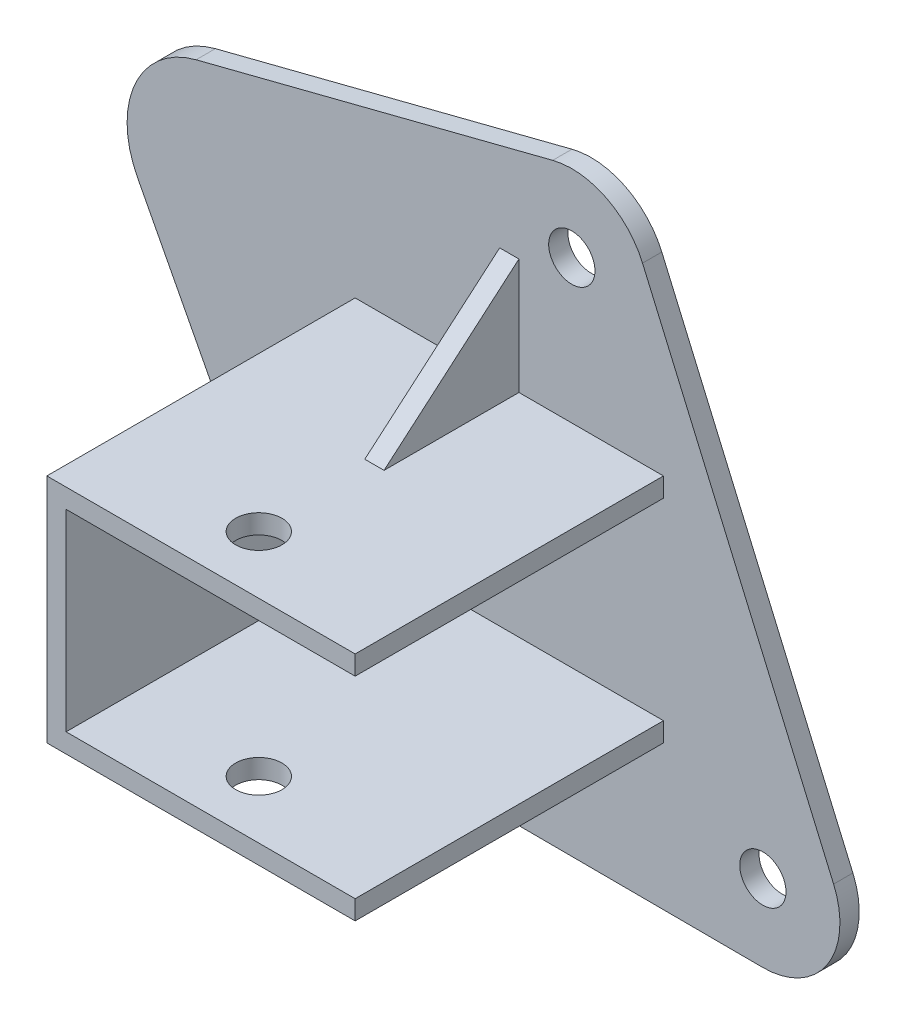
ISO-10303-21;
HEADER;
FILE_DESCRIPTION(('STEP AP214'),'2;1');
FILE_NAME('part.step','',(''),(''),'','','');
FILE_SCHEMA(('AUTOMOTIVE_DESIGN { 1 0 10303 214 1 1 1 1 }'));
ENDSEC;
DATA;
#1=APPLICATION_CONTEXT('core data for automotive mechanical design processes');
#2=APPLICATION_PROTOCOL_DEFINITION('international standard','automotive_design',2000,#1);
#3=PRODUCT_CONTEXT('',#1,'mechanical');
#4=PRODUCT('Part','Part','',(#3));
#5=PRODUCT_RELATED_PRODUCT_CATEGORY('part','',(#4));
#6=PRODUCT_DEFINITION_FORMATION('','',#4);
#7=PRODUCT_DEFINITION_CONTEXT('part definition',#1,'design');
#8=PRODUCT_DEFINITION('design','',#6,#7);
#9=PRODUCT_DEFINITION_SHAPE('','',#8);
#10=(LENGTH_UNIT() NAMED_UNIT(*) SI_UNIT(.MILLI.,.METRE.));
#11=(NAMED_UNIT(*) PLANE_ANGLE_UNIT() SI_UNIT($,.RADIAN.));
#12=(NAMED_UNIT(*) SI_UNIT($,.STERADIAN.) SOLID_ANGLE_UNIT());
#13=UNCERTAINTY_MEASURE_WITH_UNIT(LENGTH_MEASURE(1.E-05),#10,'distance_accuracy_value','');
#14=(GEOMETRIC_REPRESENTATION_CONTEXT(3) GLOBAL_UNCERTAINTY_ASSIGNED_CONTEXT((#13)) GLOBAL_UNIT_ASSIGNED_CONTEXT((#10,
#11,#12)) REPRESENTATION_CONTEXT('',''));
#15=CARTESIAN_POINT('',(0.,0.,0.));
#16=DIRECTION('',(0.,0.,1.));
#17=DIRECTION('',(1.,0.,0.));
#18=AXIS2_PLACEMENT_3D('',#15,#16,#17);
#19=CARTESIAN_POINT('',(0.,0.,5.));
#20=DIRECTION('',(0.,0.,-1.));
#21=DIRECTION('',(-1.,0.,0.));
#22=AXIS2_PLACEMENT_3D('',#19,#20,#21);
#23=PLANE('',#22);
#24=CARTESIAN_POINT('',(-530.,114.747437118608,5.));
#25=DIRECTION('',(0.,0.,1.));
#26=DIRECTION('',(1.,0.,0.));
#27=AXIS2_PLACEMENT_3D('',#24,#25,#26);
#28=CIRCLE('',#27,5.99999999999999);
#29=CARTESIAN_POINT('',(-524.,114.747437118608,5.));
#30=VERTEX_POINT('',#29);
#31=EDGE_CURVE('E361',#30,#30,#28,.T.);
#32=ORIENTED_EDGE('',*,*,#31,.F.);
#33=EDGE_LOOP('',(#32));
#34=FACE_BOUND('',#33,.T.);
#35=CARTESIAN_POINT('',(-480.421520044367,0.,5.));
#36=DIRECTION('',(0.,0.,1.));
#37=DIRECTION('',(1.,0.,0.));
#38=AXIS2_PLACEMENT_3D('',#35,#36,#37);
#39=CIRCLE('',#38,5.99999999999999);
#40=CARTESIAN_POINT('',(-474.421520044367,0.,5.));
#41=VERTEX_POINT('',#40);
#42=EDGE_CURVE('E367',#41,#41,#39,.T.);
#43=ORIENTED_EDGE('',*,*,#42,.F.);
#44=EDGE_LOOP('',(#43));
#45=FACE_BOUND('',#44,.T.);
#46=CARTESIAN_POINT('',(-580.420844253883,0.367637919948348,5.));
#47=DIRECTION('',(0.,0.,1.));
#48=DIRECTION('',(1.,0.,0.));
#49=AXIS2_PLACEMENT_3D('',#46,#47,#48);
#50=CIRCLE('',#49,5.99999999999999);
#51=CARTESIAN_POINT('',(-574.420844253883,0.367637919948348,5.));
#52=VERTEX_POINT('',#51);
#53=EDGE_CURVE('E11',#52,#52,#50,.T.);
#54=ORIENTED_EDGE('',*,*,#53,.F.);
#55=EDGE_LOOP('',(#54));
#56=FACE_BOUND('',#55,.T.);
#57=CARTESIAN_POINT('',(-480.421520044367,0.,5.));
#58=DIRECTION('',(0.,0.,1.));
#59=DIRECTION('',(1.,0.,0.));
#60=AXIS2_PLACEMENT_3D('',#57,#58,#59);
#61=CIRCLE('',#60,20.);
#62=CARTESIAN_POINT('',(-480.495047628357,-19.9998648419031,5.));
#63=VERTEX_POINT('',#62);
#64=CARTESIAN_POINT('',(-462.06193010539,7.93255679290131,5.));
#65=VERTEX_POINT('',#64);
#66=EDGE_CURVE('E318',#63,#65,#61,.T.);
#67=ORIENTED_EDGE('',*,*,#66,.T.);
#68=DIRECTION('',(-0.396627839645065,0.917979496948863,0.));
#69=VECTOR('',#68,1.);
#70=CARTESIAN_POINT('',(-511.640410061023,122.679993911509,5.));
#71=LINE('',#70,#69);
#72=CARTESIAN_POINT('',(-511.640410061023,122.679993911509,5.));
#73=VERTEX_POINT('',#72);
#74=EDGE_CURVE('E320',#65,#73,#71,.T.);
#75=ORIENTED_EDGE('',*,*,#74,.T.);
#76=CARTESIAN_POINT('',(-530.,114.747437118608,5.));
#77=DIRECTION('',(0.,0.,1.));
#78=DIRECTION('',(1.,0.,0.));
#79=AXIS2_PLACEMENT_3D('',#76,#77,#78);
#80=CIRCLE('',#79,19.9999999999999);
#81=CARTESIAN_POINT('',(-534.956009312539,134.123658930252,5.));
#82=VERTEX_POINT('',#81);
#83=EDGE_CURVE('E322',#73,#82,#80,.T.);
#84=ORIENTED_EDGE('',*,*,#83,.T.);
#85=DIRECTION('',(-0.968811090582201,-0.247800465626937,0.));
#86=VECTOR('',#85,1.);
#87=CARTESIAN_POINT('',(-534.956009312539,134.123658930252,5.));
#88=LINE('',#87,#86);
#89=CARTESIAN_POINT('',(-627.481332722389,110.457726070766,5.));
#90=VERTEX_POINT('',#89);
#91=EDGE_CURVE('E324',#82,#90,#88,.T.);
#92=ORIENTED_EDGE('',*,*,#91,.T.);
#93=CARTESIAN_POINT('',(-621.583666123486,87.3999614490659,5.));
#94=DIRECTION('',(0.,0.,1.));
#95=DIRECTION('',(1.,0.,0.));
#96=AXIS2_PLACEMENT_3D('',#93,#94,#95);
#97=CIRCLE('',#96,23.8000626188574);
#98=CARTESIAN_POINT('',(-642.680296555171,76.3829216882936,5.));
#99=VERTEX_POINT('',#98);
#100=EDGE_CURVE('E326',#90,#99,#97,.T.);
#101=ORIENTED_EDGE('',*,*,#100,.T.);
#102=DIRECTION('',(0.462899612375104,-0.886410711162144,0.));
#103=VECTOR('',#102,1.);
#104=CARTESIAN_POINT('',(-642.680296555171,76.3829216882936,5.));
#105=LINE('',#104,#103);
#106=CARTESIAN_POINT('',(-598.149058477126,-8.89035432755369,5.));
#107=VERTEX_POINT('',#106);
#108=EDGE_CURVE('E328',#99,#107,#105,.T.);
#109=ORIENTED_EDGE('',*,*,#108,.T.);
#110=CARTESIAN_POINT('',(-580.420844253883,0.367637919948348,5.));
#111=DIRECTION('',(0.,0.,1.));
#112=DIRECTION('',(1.,0.,0.));
#113=AXIS2_PLACEMENT_3D('',#110,#111,#112);
#114=CIRCLE('',#113,20.);
#115=CARTESIAN_POINT('',(-580.494371837872,-19.6322269219548,5.));
#116=VERTEX_POINT('',#115);
#117=EDGE_CURVE('E330',#107,#116,#114,.T.);
#118=ORIENTED_EDGE('',*,*,#117,.T.);
#119=DIRECTION('',(0.999993242095156,-0.00367637919948347,0.));
#120=VECTOR('',#119,1.);
#121=CARTESIAN_POINT('',(-580.494371837872,-19.6322269219548,5.));
#122=LINE('',#121,#120);
#123=EDGE_CURVE('E332',#116,#63,#122,.T.);
#124=ORIENTED_EDGE('',*,*,#123,.T.);
#125=EDGE_LOOP('',(#67,#75,#84,#92,#101,#109,#118,#124));
#126=FACE_BOUND('',#125,.T.);
#127=DIRECTION('',(1.,0.,0.));
#128=VECTOR('',#127,1.);
#129=CARTESIAN_POINT('',(-548.713116183473,-12.425240331968,5.));
#130=LINE('',#129,#128);
#131=CARTESIAN_POINT('',(-548.713116183473,-12.425240331968,5.));
#132=VERTEX_POINT('',#131);
#133=CARTESIAN_POINT('',(-543.713116183473,-12.425240331968,5.));
#134=VERTEX_POINT('',#133);
#135=EDGE_CURVE('E48',#132,#134,#130,.T.);
#136=ORIENTED_EDGE('',*,*,#135,.F.);
#137=DIRECTION('',(0.,-1.,0.));
#138=VECTOR('',#137,1.);
#139=CARTESIAN_POINT('',(-548.713116183473,17.574759668032,5.));
#140=LINE('',#139,#138);
#141=CARTESIAN_POINT('',(-548.713116183473,17.574759668032,5.));
#142=VERTEX_POINT('',#141);
#143=EDGE_CURVE('E555',#142,#132,#140,.T.);
#144=ORIENTED_EDGE('',*,*,#143,.F.);
#145=DIRECTION('',(1.,0.,0.));
#146=VECTOR('',#145,1.);
#147=CARTESIAN_POINT('',(-506.213116183473,17.574759668032,5.));
#148=LINE('',#147,#146);
#149=CARTESIAN_POINT('',(-586.213116183473,17.574759668032,5.));
#150=VERTEX_POINT('',#149);
#151=EDGE_CURVE('E261',#150,#142,#148,.T.);
#152=ORIENTED_EDGE('',*,*,#151,.F.);
#153=DIRECTION('',(0.,-1.,0.));
#154=VECTOR('',#153,1.);
#155=CARTESIAN_POINT('',(-586.213116183473,17.574759668032,5.));
#156=LINE('',#155,#154);
#157=CARTESIAN_POINT('',(-586.213116183473,77.574759668032,5.));
#158=VERTEX_POINT('',#157);
#159=EDGE_CURVE('E239',#158,#150,#156,.T.);
#160=ORIENTED_EDGE('',*,*,#159,.F.);
#161=DIRECTION('',(-1.,0.,0.));
#162=VECTOR('',#161,1.);
#163=CARTESIAN_POINT('',(-586.213116183473,77.574759668032,5.));
#164=LINE('',#163,#162);
#165=CARTESIAN_POINT('',(-548.713116183473,77.574759668032,5.));
#166=VERTEX_POINT('',#165);
#167=EDGE_CURVE('E278',#166,#158,#164,.T.);
#168=ORIENTED_EDGE('',*,*,#167,.F.);
#169=DIRECTION('',(0.,-1.,0.));
#170=VECTOR('',#169,1.);
#171=CARTESIAN_POINT('',(-548.713116183473,77.574759668032,5.));
#172=LINE('',#171,#170);
#173=CARTESIAN_POINT('',(-548.713116183473,107.574759668032,5.));
#174=VERTEX_POINT('',#173);
#175=EDGE_CURVE('E206',#174,#166,#172,.T.);
#176=ORIENTED_EDGE('',*,*,#175,.F.);
#177=DIRECTION('',(1.,0.,0.));
#178=VECTOR('',#177,1.);
#179=CARTESIAN_POINT('',(-548.713116183473,107.574759668032,5.));
#180=LINE('',#179,#178);
#181=CARTESIAN_POINT('',(-543.713116183473,107.574759668032,5.));
#182=VERTEX_POINT('',#181);
#183=EDGE_CURVE('E216',#174,#182,#180,.T.);
#184=ORIENTED_EDGE('',*,*,#183,.T.);
#185=DIRECTION('',(0.,-1.,0.));
#186=VECTOR('',#185,1.);
#187=CARTESIAN_POINT('',(-543.713116183473,77.574759668032,5.));
#188=LINE('',#187,#186);
#189=CARTESIAN_POINT('',(-543.713116183473,77.574759668032,5.));
#190=VERTEX_POINT('',#189);
#191=EDGE_CURVE('E205',#182,#190,#188,.T.);
#192=ORIENTED_EDGE('',*,*,#191,.T.);
#193=CARTESIAN_POINT('',(-506.213116183473,77.574759668032,5.));
#194=VERTEX_POINT('',#193);
#195=EDGE_CURVE('E243',#194,#190,#164,.T.);
#196=ORIENTED_EDGE('',*,*,#195,.F.);
#197=DIRECTION('',(0.,1.,0.));
#198=VECTOR('',#197,1.);
#199=CARTESIAN_POINT('',(-506.213116183473,77.574759668032,5.));
#200=LINE('',#199,#198);
#201=CARTESIAN_POINT('',(-506.213116183473,72.574759668032,5.));
#202=VERTEX_POINT('',#201);
#203=EDGE_CURVE('E275',#202,#194,#200,.T.);
#204=ORIENTED_EDGE('',*,*,#203,.F.);
#205=DIRECTION('',(1.,0.,0.));
#206=VECTOR('',#205,1.);
#207=CARTESIAN_POINT('',(-581.213116183473,72.574759668032,5.));
#208=LINE('',#207,#206);
#209=CARTESIAN_POINT('',(-581.213116183473,72.574759668032,5.));
#210=VERTEX_POINT('',#209);
#211=EDGE_CURVE('E272',#210,#202,#208,.T.);
#212=ORIENTED_EDGE('',*,*,#211,.F.);
#213=DIRECTION('',(0.,1.,0.));
#214=VECTOR('',#213,1.);
#215=CARTESIAN_POINT('',(-581.213116183473,22.574759668032,5.));
#216=LINE('',#215,#214);
#217=CARTESIAN_POINT('',(-581.213116183473,22.574759668032,5.));
#218=VERTEX_POINT('',#217);
#219=EDGE_CURVE('E269',#218,#210,#216,.T.);
#220=ORIENTED_EDGE('',*,*,#219,.F.);
#221=DIRECTION('',(-1.,0.,0.));
#222=VECTOR('',#221,1.);
#223=CARTESIAN_POINT('',(-506.213116183473,22.574759668032,5.));
#224=LINE('',#223,#222);
#225=CARTESIAN_POINT('',(-506.213116183473,22.574759668032,5.));
#226=VERTEX_POINT('',#225);
#227=EDGE_CURVE('E266',#226,#218,#224,.T.);
#228=ORIENTED_EDGE('',*,*,#227,.F.);
#229=DIRECTION('',(0.,1.,0.));
#230=VECTOR('',#229,1.);
#231=CARTESIAN_POINT('',(-506.213116183473,17.574759668032,5.));
#232=LINE('',#231,#230);
#233=CARTESIAN_POINT('',(-506.213116183473,17.574759668032,5.));
#234=VERTEX_POINT('',#233);
#235=EDGE_CURVE('E263',#234,#226,#232,.T.);
#236=ORIENTED_EDGE('',*,*,#235,.F.);
#237=CARTESIAN_POINT('',(-543.713116183473,17.574759668032,5.));
#238=VERTEX_POINT('',#237);
#239=EDGE_CURVE('E260',#238,#234,#148,.T.);
#240=ORIENTED_EDGE('',*,*,#239,.F.);
#241=DIRECTION('',(0.,-1.,0.));
#242=VECTOR('',#241,1.);
#243=CARTESIAN_POINT('',(-543.713116183473,17.574759668032,5.));
#244=LINE('',#243,#242);
#245=EDGE_CURVE('E53',#238,#134,#244,.T.);
#246=ORIENTED_EDGE('',*,*,#245,.T.);
#247=EDGE_LOOP('',(#136,#144,#152,#160,#168,#176,#184,#192,#196,#204,#212,#220,#228,#236,#240,#246));
#248=FACE_BOUND('',#247,.T.);
#249=ADVANCED_FACE('F33',(#34,#45,#56,#126,#248),#23,.F.);
#250=CARTESIAN_POINT('',(0.,0.,0.));
#251=DIRECTION('',(0.,0.,-1.));
#252=DIRECTION('',(-1.,0.,0.));
#253=AXIS2_PLACEMENT_3D('',#250,#251,#252);
#254=PLANE('',#253);
#255=DIRECTION('',(-0.396627839645065,0.917979496948863,0.));
#256=VECTOR('',#255,1.);
#257=CARTESIAN_POINT('',(-511.640410061023,122.679993911509,0.));
#258=LINE('',#257,#256);
#259=CARTESIAN_POINT('',(-462.06193010539,7.93255679290131,0.));
#260=VERTEX_POINT('',#259);
#261=CARTESIAN_POINT('',(-511.640410061023,122.679993911509,0.));
#262=VERTEX_POINT('',#261);
#263=EDGE_CURVE('E338',#260,#262,#258,.T.);
#264=ORIENTED_EDGE('',*,*,#263,.F.);
#265=CARTESIAN_POINT('',(-480.421520044367,0.,0.));
#266=DIRECTION('',(0.,0.,-1.));
#267=DIRECTION('',(-1.,0.,0.));
#268=AXIS2_PLACEMENT_3D('',#265,#266,#267);
#269=CIRCLE('',#268,20.);
#270=CARTESIAN_POINT('',(-480.495047628357,-19.9998648419031,0.));
#271=VERTEX_POINT('',#270);
#272=EDGE_CURVE('E315',#271,#260,#269,.F.);
#273=ORIENTED_EDGE('',*,*,#272,.F.);
#274=DIRECTION('',(0.999993242095156,-0.00367637919948347,0.));
#275=VECTOR('',#274,1.);
#276=CARTESIAN_POINT('',(-580.494371837872,-19.6322269219548,0.));
#277=LINE('',#276,#275);
#278=CARTESIAN_POINT('',(-580.494371837872,-19.6322269219548,0.));
#279=VERTEX_POINT('',#278);
#280=EDGE_CURVE('E313',#279,#271,#277,.T.);
#281=ORIENTED_EDGE('',*,*,#280,.F.);
#282=CARTESIAN_POINT('',(-580.420844253883,0.367637919948348,0.));
#283=DIRECTION('',(0.,0.,-1.));
#284=DIRECTION('',(-1.,0.,0.));
#285=AXIS2_PLACEMENT_3D('',#282,#283,#284);
#286=CIRCLE('',#285,20.);
#287=CARTESIAN_POINT('',(-598.149058477126,-8.89035432755372,0.));
#288=VERTEX_POINT('',#287);
#289=EDGE_CURVE('E311',#288,#279,#286,.F.);
#290=ORIENTED_EDGE('',*,*,#289,.F.);
#291=DIRECTION('',(0.462899612375104,-0.886410711162144,0.));
#292=VECTOR('',#291,1.);
#293=CARTESIAN_POINT('',(-642.680296555171,76.3829216882936,0.));
#294=LINE('',#293,#292);
#295=CARTESIAN_POINT('',(-642.680296555171,76.3829216882936,0.));
#296=VERTEX_POINT('',#295);
#297=EDGE_CURVE('E309',#296,#288,#294,.T.);
#298=ORIENTED_EDGE('',*,*,#297,.F.);
#299=CARTESIAN_POINT('',(-621.583666123486,87.3999614490659,0.));
#300=DIRECTION('',(0.,0.,-1.));
#301=DIRECTION('',(-1.,0.,0.));
#302=AXIS2_PLACEMENT_3D('',#299,#300,#301);
#303=CIRCLE('',#302,23.8000626188574);
#304=CARTESIAN_POINT('',(-627.481332722389,110.457726070766,0.));
#305=VERTEX_POINT('',#304);
#306=EDGE_CURVE('E307',#305,#296,#303,.F.);
#307=ORIENTED_EDGE('',*,*,#306,.F.);
#308=DIRECTION('',(-0.968811090582201,-0.247800465626937,0.));
#309=VECTOR('',#308,1.);
#310=CARTESIAN_POINT('',(-534.956009312539,134.123658930252,0.));
#311=LINE('',#310,#309);
#312=CARTESIAN_POINT('',(-534.956009312539,134.123658930252,0.));
#313=VERTEX_POINT('',#312);
#314=EDGE_CURVE('E305',#313,#305,#311,.T.);
#315=ORIENTED_EDGE('',*,*,#314,.F.);
#316=CARTESIAN_POINT('',(-530.,114.747437118608,0.));
#317=DIRECTION('',(0.,0.,-1.));
#318=DIRECTION('',(-1.,0.,0.));
#319=AXIS2_PLACEMENT_3D('',#316,#317,#318);
#320=CIRCLE('',#319,19.9999999999999);
#321=EDGE_CURVE('E303',#262,#313,#320,.F.);
#322=ORIENTED_EDGE('',*,*,#321,.F.);
#323=EDGE_LOOP('',(#264,#273,#281,#290,#298,#307,#315,#322));
#324=FACE_BOUND('',#323,.T.);
#325=CARTESIAN_POINT('',(-480.421520044367,0.,0.));
#326=DIRECTION('',(0.,0.,1.));
#327=DIRECTION('',(1.,0.,0.));
#328=AXIS2_PLACEMENT_3D('',#325,#326,#327);
#329=CIRCLE('',#328,5.99999999999999);
#330=CARTESIAN_POINT('',(-474.421520044367,0.,0.));
#331=VERTEX_POINT('',#330);
#332=EDGE_CURVE('E364',#331,#331,#329,.T.);
#333=ORIENTED_EDGE('',*,*,#332,.T.);
#334=EDGE_LOOP('',(#333));
#335=FACE_BOUND('',#334,.T.);
#336=CARTESIAN_POINT('',(-580.420844253883,0.367637919948348,0.));
#337=DIRECTION('',(0.,0.,1.));
#338=DIRECTION('',(1.,0.,0.));
#339=AXIS2_PLACEMENT_3D('',#336,#337,#338);
#340=CIRCLE('',#339,5.99999999999999);
#341=CARTESIAN_POINT('',(-574.420844253883,0.367637919948348,0.));
#342=VERTEX_POINT('',#341);
#343=EDGE_CURVE('E37',#342,#342,#340,.T.);
#344=ORIENTED_EDGE('',*,*,#343,.T.);
#345=EDGE_LOOP('',(#344));
#346=FACE_BOUND('',#345,.T.);
#347=CARTESIAN_POINT('',(-530.,114.747437118608,0.));
#348=DIRECTION('',(0.,0.,1.));
#349=DIRECTION('',(1.,0.,0.));
#350=AXIS2_PLACEMENT_3D('',#347,#348,#349);
#351=CIRCLE('',#350,5.99999999999999);
#352=CARTESIAN_POINT('',(-524.,114.747437118608,0.));
#353=VERTEX_POINT('',#352);
#354=EDGE_CURVE('E360',#353,#353,#351,.T.);
#355=ORIENTED_EDGE('',*,*,#354,.T.);
#356=EDGE_LOOP('',(#355));
#357=FACE_BOUND('',#356,.T.);
#358=ADVANCED_FACE('F35',(#324,#335,#346,#357),#254,.T.);
#359=CARTESIAN_POINT('',(-580.420844253883,0.367637919948348,5.));
#360=DIRECTION('',(0.,0.,-1.));
#361=DIRECTION('',(-1.,0.,0.));
#362=AXIS2_PLACEMENT_3D('',#359,#360,#361);
#363=CYLINDRICAL_SURFACE('',#362,5.99999999999999);
#364=ORIENTED_EDGE('',*,*,#53,.T.);
#365=EDGE_LOOP('',(#364));
#366=FACE_BOUND('',#365,.T.);
#367=ORIENTED_EDGE('',*,*,#343,.F.);
#368=EDGE_LOOP('',(#367));
#369=FACE_BOUND('',#368,.T.);
#370=ADVANCED_FACE('F378',(#366,#369),#363,.F.);
#371=CARTESIAN_POINT('',(-480.421520044367,0.,5.));
#372=DIRECTION('',(0.,0.,-1.));
#373=DIRECTION('',(-1.,0.,0.));
#374=AXIS2_PLACEMENT_3D('',#371,#372,#373);
#375=CYLINDRICAL_SURFACE('',#374,5.99999999999999);
#376=ORIENTED_EDGE('',*,*,#42,.T.);
#377=EDGE_LOOP('',(#376));
#378=FACE_BOUND('',#377,.T.);
#379=ORIENTED_EDGE('',*,*,#332,.F.);
#380=EDGE_LOOP('',(#379));
#381=FACE_BOUND('',#380,.T.);
#382=ADVANCED_FACE('F375',(#378,#381),#375,.F.);
#383=CARTESIAN_POINT('',(-530.,114.747437118608,5.));
#384=DIRECTION('',(0.,0.,-1.));
#385=DIRECTION('',(-1.,0.,0.));
#386=AXIS2_PLACEMENT_3D('',#383,#384,#385);
#387=CYLINDRICAL_SURFACE('',#386,5.99999999999999);
#388=ORIENTED_EDGE('',*,*,#31,.T.);
#389=EDGE_LOOP('',(#388));
#390=FACE_BOUND('',#389,.T.);
#391=ORIENTED_EDGE('',*,*,#354,.F.);
#392=EDGE_LOOP('',(#391));
#393=FACE_BOUND('',#392,.T.);
#394=ADVANCED_FACE('F377',(#390,#393),#387,.F.);
#395=CARTESIAN_POINT('',(-480.421520044367,0.,-0.00100000000000013));
#396=DIRECTION('',(0.,0.,1.));
#397=DIRECTION('',(1.,0.,0.));
#398=AXIS2_PLACEMENT_3D('',#395,#396,#397);
#399=CYLINDRICAL_SURFACE('',#398,20.);
#400=DIRECTION('',(0.,0.,1.));
#401=VECTOR('',#400,1.);
#402=CARTESIAN_POINT('',(-480.495047628357,-19.9998648419031,-0.00100000000000013));
#403=LINE('',#402,#401);
#404=EDGE_CURVE('E335',#271,#63,#403,.T.);
#405=ORIENTED_EDGE('',*,*,#404,.F.);
#406=ORIENTED_EDGE('',*,*,#272,.T.);
#407=DIRECTION('',(0.,0.,1.));
#408=VECTOR('',#407,1.);
#409=CARTESIAN_POINT('',(-462.06193010539,7.93255679290131,-0.00100000000000013));
#410=LINE('',#409,#408);
#411=EDGE_CURVE('E334',#260,#65,#410,.T.);
#412=ORIENTED_EDGE('',*,*,#411,.T.);
#413=ORIENTED_EDGE('',*,*,#66,.F.);
#414=EDGE_LOOP('',(#405,#406,#412,#413));
#415=FACE_BOUND('',#414,.T.);
#416=ADVANCED_FACE('F385',(#415),#399,.T.);
#417=CARTESIAN_POINT('',(-580.494371837872,-19.6322269219548,-0.00100000000000013));
#418=DIRECTION('',(-0.00367637919948347,-0.999993242095156,0.));
#419=DIRECTION('',(0.999993242095156,-0.00367637919948347,0.));
#420=AXIS2_PLACEMENT_3D('',#417,#418,#419);
#421=PLANE('',#420);
#422=DIRECTION('',(0.,0.,1.));
#423=VECTOR('',#422,1.);
#424=CARTESIAN_POINT('',(-580.494371837872,-19.6322269219548,-0.00100000000000013));
#425=LINE('',#424,#423);
#426=EDGE_CURVE('E339',#279,#116,#425,.T.);
#427=ORIENTED_EDGE('',*,*,#426,.F.);
#428=ORIENTED_EDGE('',*,*,#280,.T.);
#429=ORIENTED_EDGE('',*,*,#404,.T.);
#430=ORIENTED_EDGE('',*,*,#123,.F.);
#431=EDGE_LOOP('',(#427,#428,#429,#430));
#432=FACE_BOUND('',#431,.T.);
#433=ADVANCED_FACE('F441',(#432),#421,.T.);
#434=CARTESIAN_POINT('',(-580.420844253883,0.367637919948348,-0.00100000000000013));
#435=DIRECTION('',(0.,0.,1.));
#436=DIRECTION('',(1.,0.,0.));
#437=AXIS2_PLACEMENT_3D('',#434,#435,#436);
#438=CYLINDRICAL_SURFACE('',#437,20.);
#439=DIRECTION('',(0.,0.,1.));
#440=VECTOR('',#439,1.);
#441=CARTESIAN_POINT('',(-598.149058477126,-8.89035432755373,-0.00100000000000013));
#442=LINE('',#441,#440);
#443=EDGE_CURVE('E342',#288,#107,#442,.T.);
#444=ORIENTED_EDGE('',*,*,#443,.F.);
#445=ORIENTED_EDGE('',*,*,#289,.T.);
#446=ORIENTED_EDGE('',*,*,#426,.T.);
#447=ORIENTED_EDGE('',*,*,#117,.F.);
#448=EDGE_LOOP('',(#444,#445,#446,#447));
#449=FACE_BOUND('',#448,.T.);
#450=ADVANCED_FACE('F437',(#449),#438,.T.);
#451=CARTESIAN_POINT('',(-642.680296555171,76.3829216882936,-0.00100000000000013));
#452=DIRECTION('',(-0.886410711162144,-0.462899612375104,0.));
#453=DIRECTION('',(0.462899612375104,-0.886410711162144,0.));
#454=AXIS2_PLACEMENT_3D('',#451,#452,#453);
#455=PLANE('',#454);
#456=DIRECTION('',(0.,0.,1.));
#457=VECTOR('',#456,1.);
#458=CARTESIAN_POINT('',(-642.680296555171,76.3829216882936,-0.00100000000000013));
#459=LINE('',#458,#457);
#460=EDGE_CURVE('E345',#296,#99,#459,.T.);
#461=ORIENTED_EDGE('',*,*,#460,.F.);
#462=ORIENTED_EDGE('',*,*,#297,.T.);
#463=ORIENTED_EDGE('',*,*,#443,.T.);
#464=ORIENTED_EDGE('',*,*,#108,.F.);
#465=EDGE_LOOP('',(#461,#462,#463,#464));
#466=FACE_BOUND('',#465,.T.);
#467=ADVANCED_FACE('F432',(#466),#455,.T.);
#468=CARTESIAN_POINT('',(-621.583666123486,87.3999614490659,-0.00100000000000013));
#469=DIRECTION('',(0.,0.,1.));
#470=DIRECTION('',(1.,0.,0.));
#471=AXIS2_PLACEMENT_3D('',#468,#469,#470);
#472=CYLINDRICAL_SURFACE('',#471,23.8000626188574);
#473=DIRECTION('',(0.,0.,1.));
#474=VECTOR('',#473,1.);
#475=CARTESIAN_POINT('',(-627.481332722389,110.457726070766,-0.00100000000000013));
#476=LINE('',#475,#474);
#477=EDGE_CURVE('E348',#305,#90,#476,.T.);
#478=ORIENTED_EDGE('',*,*,#477,.F.);
#479=ORIENTED_EDGE('',*,*,#306,.T.);
#480=ORIENTED_EDGE('',*,*,#460,.T.);
#481=ORIENTED_EDGE('',*,*,#100,.F.);
#482=EDGE_LOOP('',(#478,#479,#480,#481));
#483=FACE_BOUND('',#482,.T.);
#484=ADVANCED_FACE('F427',(#483),#472,.T.);
#485=CARTESIAN_POINT('',(-534.956009312539,134.123658930252,-0.00100000000000013));
#486=DIRECTION('',(-0.247800465626937,0.968811090582201,0.));
#487=DIRECTION('',(-0.968811090582201,-0.247800465626937,0.));
#488=AXIS2_PLACEMENT_3D('',#485,#486,#487);
#489=PLANE('',#488);
#490=DIRECTION('',(0.,0.,1.));
#491=VECTOR('',#490,1.);
#492=CARTESIAN_POINT('',(-534.956009312539,134.123658930252,-0.00100000000000013));
#493=LINE('',#492,#491);
#494=EDGE_CURVE('E351',#313,#82,#493,.T.);
#495=ORIENTED_EDGE('',*,*,#494,.F.);
#496=ORIENTED_EDGE('',*,*,#314,.T.);
#497=ORIENTED_EDGE('',*,*,#477,.T.);
#498=ORIENTED_EDGE('',*,*,#91,.F.);
#499=EDGE_LOOP('',(#495,#496,#497,#498));
#500=FACE_BOUND('',#499,.T.);
#501=ADVANCED_FACE('F423',(#500),#489,.T.);
#502=CARTESIAN_POINT('',(-530.,114.747437118608,-0.00100000000000013));
#503=DIRECTION('',(0.,0.,1.));
#504=DIRECTION('',(1.,0.,0.));
#505=AXIS2_PLACEMENT_3D('',#502,#503,#504);
#506=CYLINDRICAL_SURFACE('',#505,19.9999999999999);
#507=DIRECTION('',(0.,0.,1.));
#508=VECTOR('',#507,1.);
#509=CARTESIAN_POINT('',(-511.640410061023,122.679993911509,-0.00100000000000013));
#510=LINE('',#509,#508);
#511=EDGE_CURVE('E354',#262,#73,#510,.T.);
#512=ORIENTED_EDGE('',*,*,#511,.F.);
#513=ORIENTED_EDGE('',*,*,#321,.T.);
#514=ORIENTED_EDGE('',*,*,#494,.T.);
#515=ORIENTED_EDGE('',*,*,#83,.F.);
#516=EDGE_LOOP('',(#512,#513,#514,#515));
#517=FACE_BOUND('',#516,.T.);
#518=ADVANCED_FACE('F417',(#517),#506,.T.);
#519=CARTESIAN_POINT('',(-511.640410061023,122.679993911509,-0.00100000000000013));
#520=DIRECTION('',(0.917979496948863,0.396627839645065,0.));
#521=DIRECTION('',(-0.396627839645065,0.917979496948863,0.));
#522=AXIS2_PLACEMENT_3D('',#519,#520,#521);
#523=PLANE('',#522);
#524=ORIENTED_EDGE('',*,*,#411,.F.);
#525=ORIENTED_EDGE('',*,*,#263,.T.);
#526=ORIENTED_EDGE('',*,*,#511,.T.);
#527=ORIENTED_EDGE('',*,*,#74,.F.);
#528=EDGE_LOOP('',(#524,#525,#526,#527));
#529=FACE_BOUND('',#528,.T.);
#530=ADVANCED_FACE('F412',(#529),#523,.T.);
#531=CARTESIAN_POINT('',(-586.213116183473,17.574759668032,85.));
#532=DIRECTION('',(1.,0.,0.));
#533=DIRECTION('',(0.,0.,-1.));
#534=AXIS2_PLACEMENT_3D('',#531,#532,#533);
#535=PLANE('',#534);
#536=ORIENTED_EDGE('',*,*,#159,.T.);
#537=DIRECTION('',(0.,0.,-1.));
#538=VECTOR('',#537,1.);
#539=CARTESIAN_POINT('',(-586.213116183473,17.574759668032,85.));
#540=LINE('',#539,#538);
#541=CARTESIAN_POINT('',(-586.213116183473,17.574759668032,85.));
#542=VERTEX_POINT('',#541);
#543=EDGE_CURVE('E300',#542,#150,#540,.T.);
#544=ORIENTED_EDGE('',*,*,#543,.F.);
#545=DIRECTION('',(0.,-1.,0.));
#546=VECTOR('',#545,1.);
#547=CARTESIAN_POINT('',(-586.213116183473,77.574759668032,85.));
#548=LINE('',#547,#546);
#549=CARTESIAN_POINT('',(-586.213116183473,77.574759668032,85.));
#550=VERTEX_POINT('',#549);
#551=EDGE_CURVE('E240',#550,#542,#548,.T.);
#552=ORIENTED_EDGE('',*,*,#551,.F.);
#553=DIRECTION('',(0.,0.,-1.));
#554=VECTOR('',#553,1.);
#555=CARTESIAN_POINT('',(-586.213116183473,77.574759668032,85.));
#556=LINE('',#555,#554);
#557=EDGE_CURVE('E257',#550,#158,#556,.T.);
#558=ORIENTED_EDGE('',*,*,#557,.T.);
#559=EDGE_LOOP('',(#536,#544,#552,#558));
#560=FACE_BOUND('',#559,.T.);
#561=ADVANCED_FACE('F451',(#560),#535,.F.);
#562=CARTESIAN_POINT('',(-506.213116183473,17.574759668032,85.));
#563=DIRECTION('',(0.,1.,0.));
#564=DIRECTION('',(-1.,0.,0.));
#565=AXIS2_PLACEMENT_3D('',#562,#563,#564);
#566=PLANE('',#565);
#567=CARTESIAN_POINT('',(-546.213116183473,17.574759668032,70.));
#568=DIRECTION('',(0.,1.,0.));
#569=DIRECTION('',(-1.,0.,0.));
#570=AXIS2_PLACEMENT_3D('',#567,#568,#569);
#571=CIRCLE('',#570,5.99999999999999);
#572=CARTESIAN_POINT('',(-552.213116183473,17.574759668032,70.));
#573=VERTEX_POINT('',#572);
#574=EDGE_CURVE('E236',#573,#573,#571,.T.);
#575=ORIENTED_EDGE('',*,*,#574,.T.);
#576=EDGE_LOOP('',(#575));
#577=FACE_BOUND('',#576,.T.);
#578=ORIENTED_EDGE('',*,*,#151,.T.);
#579=DIRECTION('',(0.,0.,-1.));
#580=VECTOR('',#579,1.);
#581=CARTESIAN_POINT('',(-548.713116183473,17.574759668032,40.));
#582=LINE('',#581,#580);
#583=CARTESIAN_POINT('',(-548.713116183473,17.574759668032,40.));
#584=VERTEX_POINT('',#583);
#585=EDGE_CURVE('E187',#584,#142,#582,.T.);
#586=ORIENTED_EDGE('',*,*,#585,.F.);
#587=DIRECTION('',(1.,0.,0.));
#588=VECTOR('',#587,1.);
#589=CARTESIAN_POINT('',(-548.713116183473,17.574759668032,40.));
#590=LINE('',#589,#588);
#591=CARTESIAN_POINT('',(-543.713116183473,17.574759668032,40.));
#592=VERTEX_POINT('',#591);
#593=EDGE_CURVE('E180',#584,#592,#590,.T.);
#594=ORIENTED_EDGE('',*,*,#593,.T.);
#595=DIRECTION('',(0.,0.,-1.));
#596=VECTOR('',#595,1.);
#597=CARTESIAN_POINT('',(-543.713116183473,17.574759668032,40.));
#598=LINE('',#597,#596);
#599=EDGE_CURVE('E185',#592,#238,#598,.T.);
#600=ORIENTED_EDGE('',*,*,#599,.T.);
#601=ORIENTED_EDGE('',*,*,#239,.T.);
#602=DIRECTION('',(0.,0.,-1.));
#603=VECTOR('',#602,1.);
#604=CARTESIAN_POINT('',(-506.213116183473,17.574759668032,85.));
#605=LINE('',#604,#603);
#606=CARTESIAN_POINT('',(-506.213116183473,17.574759668032,85.));
#607=VERTEX_POINT('',#606);
#608=EDGE_CURVE('E297',#607,#234,#605,.T.);
#609=ORIENTED_EDGE('',*,*,#608,.F.);
#610=DIRECTION('',(1.,0.,0.));
#611=VECTOR('',#610,1.);
#612=CARTESIAN_POINT('',(-506.213116183473,17.574759668032,85.));
#613=LINE('',#612,#611);
#614=EDGE_CURVE('E242',#542,#607,#613,.T.);
#615=ORIENTED_EDGE('',*,*,#614,.F.);
#616=ORIENTED_EDGE('',*,*,#543,.T.);
#617=EDGE_LOOP('',(#578,#586,#594,#600,#601,#609,#615,#616));
#618=FACE_BOUND('',#617,.T.);
#619=ADVANCED_FACE('F183',(#577,#618),#566,.F.);
#620=CARTESIAN_POINT('',(-506.213116183473,17.574759668032,85.));
#621=DIRECTION('',(-1.,0.,0.));
#622=DIRECTION('',(0.,0.,1.));
#623=AXIS2_PLACEMENT_3D('',#620,#621,#622);
#624=PLANE('',#623);
#625=ORIENTED_EDGE('',*,*,#235,.T.);
#626=DIRECTION('',(0.,0.,-1.));
#627=VECTOR('',#626,1.);
#628=CARTESIAN_POINT('',(-506.213116183473,22.574759668032,85.));
#629=LINE('',#628,#627);
#630=CARTESIAN_POINT('',(-506.213116183473,22.574759668032,85.));
#631=VERTEX_POINT('',#630);
#632=EDGE_CURVE('E294',#631,#226,#629,.T.);
#633=ORIENTED_EDGE('',*,*,#632,.F.);
#634=DIRECTION('',(0.,1.,0.));
#635=VECTOR('',#634,1.);
#636=CARTESIAN_POINT('',(-506.213116183473,17.574759668032,85.));
#637=LINE('',#636,#635);
#638=EDGE_CURVE('E245',#607,#631,#637,.T.);
#639=ORIENTED_EDGE('',*,*,#638,.F.);
#640=ORIENTED_EDGE('',*,*,#608,.T.);
#641=EDGE_LOOP('',(#625,#633,#639,#640));
#642=FACE_BOUND('',#641,.T.);
#643=ADVANCED_FACE('F470',(#642),#624,.F.);
#644=CARTESIAN_POINT('',(-506.213116183473,22.574759668032,85.));
#645=DIRECTION('',(0.,-1.,0.));
#646=DIRECTION('',(1.,0.,0.));
#647=AXIS2_PLACEMENT_3D('',#644,#645,#646);
#648=PLANE('',#647);
#649=CARTESIAN_POINT('',(-546.213116183473,22.574759668032,70.));
#650=DIRECTION('',(0.,-1.,0.));
#651=DIRECTION('',(1.,0.,0.));
#652=AXIS2_PLACEMENT_3D('',#649,#650,#651);
#653=CIRCLE('',#652,5.99999999999999);
#654=CARTESIAN_POINT('',(-540.213116183473,22.574759668032,70.));
#655=VERTEX_POINT('',#654);
#656=EDGE_CURVE('E233',#655,#655,#653,.T.);
#657=ORIENTED_EDGE('',*,*,#656,.T.);
#658=EDGE_LOOP('',(#657));
#659=FACE_BOUND('',#658,.T.);
#660=ORIENTED_EDGE('',*,*,#227,.T.);
#661=DIRECTION('',(0.,0.,-1.));
#662=VECTOR('',#661,1.);
#663=CARTESIAN_POINT('',(-581.213116183473,22.574759668032,85.));
#664=LINE('',#663,#662);
#665=CARTESIAN_POINT('',(-581.213116183473,22.574759668032,85.));
#666=VERTEX_POINT('',#665);
#667=EDGE_CURVE('E291',#666,#218,#664,.T.);
#668=ORIENTED_EDGE('',*,*,#667,.F.);
#669=DIRECTION('',(-1.,0.,0.));
#670=VECTOR('',#669,1.);
#671=CARTESIAN_POINT('',(-506.213116183473,22.574759668032,85.));
#672=LINE('',#671,#670);
#673=EDGE_CURVE('E247',#631,#666,#672,.T.);
#674=ORIENTED_EDGE('',*,*,#673,.F.);
#675=ORIENTED_EDGE('',*,*,#632,.T.);
#676=EDGE_LOOP('',(#660,#668,#674,#675));
#677=FACE_BOUND('',#676,.T.);
#678=ADVANCED_FACE('F512',(#659,#677),#648,.F.);
#679=CARTESIAN_POINT('',(-581.213116183473,22.574759668032,85.));
#680=DIRECTION('',(-1.,0.,0.));
#681=DIRECTION('',(0.,0.,1.));
#682=AXIS2_PLACEMENT_3D('',#679,#680,#681);
#683=PLANE('',#682);
#684=ORIENTED_EDGE('',*,*,#219,.T.);
#685=DIRECTION('',(0.,0.,-1.));
#686=VECTOR('',#685,1.);
#687=CARTESIAN_POINT('',(-581.213116183473,72.574759668032,85.));
#688=LINE('',#687,#686);
#689=CARTESIAN_POINT('',(-581.213116183473,72.574759668032,85.));
#690=VERTEX_POINT('',#689);
#691=EDGE_CURVE('E288',#690,#210,#688,.T.);
#692=ORIENTED_EDGE('',*,*,#691,.F.);
#693=DIRECTION('',(0.,1.,0.));
#694=VECTOR('',#693,1.);
#695=CARTESIAN_POINT('',(-581.213116183473,22.574759668032,85.));
#696=LINE('',#695,#694);
#697=EDGE_CURVE('E249',#666,#690,#696,.T.);
#698=ORIENTED_EDGE('',*,*,#697,.F.);
#699=ORIENTED_EDGE('',*,*,#667,.T.);
#700=EDGE_LOOP('',(#684,#692,#698,#699));
#701=FACE_BOUND('',#700,.T.);
#702=ADVANCED_FACE('F508',(#701),#683,.F.);
#703=CARTESIAN_POINT('',(-581.213116183473,72.574759668032,85.));
#704=DIRECTION('',(0.,1.,0.));
#705=DIRECTION('',(0.,0.,1.));
#706=AXIS2_PLACEMENT_3D('',#703,#704,#705);
#707=PLANE('',#706);
#708=CARTESIAN_POINT('',(-546.213116183473,72.574759668032,70.));
#709=DIRECTION('',(0.,1.,0.));
#710=DIRECTION('',(0.,0.,1.));
#711=AXIS2_PLACEMENT_3D('',#708,#709,#710);
#712=CIRCLE('',#711,5.99999999999999);
#713=CARTESIAN_POINT('',(-546.213116183473,72.574759668032,76.));
#714=VERTEX_POINT('',#713);
#715=EDGE_CURVE('E230',#714,#714,#712,.T.);
#716=ORIENTED_EDGE('',*,*,#715,.T.);
#717=EDGE_LOOP('',(#716));
#718=FACE_BOUND('',#717,.T.);
#719=ORIENTED_EDGE('',*,*,#211,.T.);
#720=DIRECTION('',(0.,0.,-1.));
#721=VECTOR('',#720,1.);
#722=CARTESIAN_POINT('',(-506.213116183473,72.574759668032,85.));
#723=LINE('',#722,#721);
#724=CARTESIAN_POINT('',(-506.213116183473,72.574759668032,85.));
#725=VERTEX_POINT('',#724);
#726=EDGE_CURVE('E285',#725,#202,#723,.T.);
#727=ORIENTED_EDGE('',*,*,#726,.F.);
#728=DIRECTION('',(1.,0.,0.));
#729=VECTOR('',#728,1.);
#730=CARTESIAN_POINT('',(-581.213116183473,72.574759668032,85.));
#731=LINE('',#730,#729);
#732=EDGE_CURVE('E251',#690,#725,#731,.T.);
#733=ORIENTED_EDGE('',*,*,#732,.F.);
#734=ORIENTED_EDGE('',*,*,#691,.T.);
#735=EDGE_LOOP('',(#719,#727,#733,#734));
#736=FACE_BOUND('',#735,.T.);
#737=ADVANCED_FACE('F503',(#718,#736),#707,.F.);
#738=CARTESIAN_POINT('',(-506.213116183473,77.574759668032,85.));
#739=DIRECTION('',(-1.,0.,0.));
#740=DIRECTION('',(0.,0.,1.));
#741=AXIS2_PLACEMENT_3D('',#738,#739,#740);
#742=PLANE('',#741);
#743=ORIENTED_EDGE('',*,*,#203,.T.);
#744=DIRECTION('',(0.,0.,-1.));
#745=VECTOR('',#744,1.);
#746=CARTESIAN_POINT('',(-506.213116183473,77.574759668032,85.));
#747=LINE('',#746,#745);
#748=CARTESIAN_POINT('',(-506.213116183473,77.574759668032,85.));
#749=VERTEX_POINT('',#748);
#750=EDGE_CURVE('E282',#749,#194,#747,.T.);
#751=ORIENTED_EDGE('',*,*,#750,.F.);
#752=DIRECTION('',(0.,1.,0.));
#753=VECTOR('',#752,1.);
#754=CARTESIAN_POINT('',(-506.213116183473,77.574759668032,85.));
#755=LINE('',#754,#753);
#756=EDGE_CURVE('E253',#725,#749,#755,.T.);
#757=ORIENTED_EDGE('',*,*,#756,.F.);
#758=ORIENTED_EDGE('',*,*,#726,.T.);
#759=EDGE_LOOP('',(#743,#751,#757,#758));
#760=FACE_BOUND('',#759,.T.);
#761=ADVANCED_FACE('F500',(#760),#742,.F.);
#762=CARTESIAN_POINT('',(-586.213116183473,77.574759668032,85.));
#763=DIRECTION('',(0.,-1.,0.));
#764=DIRECTION('',(0.,0.,-1.));
#765=AXIS2_PLACEMENT_3D('',#762,#763,#764);
#766=PLANE('',#765);
#767=CARTESIAN_POINT('',(-546.213116183473,77.574759668032,70.));
#768=DIRECTION('',(0.,1.,0.));
#769=DIRECTION('',(0.,0.,1.));
#770=AXIS2_PLACEMENT_3D('',#767,#768,#769);
#771=CIRCLE('',#770,5.99999999999999);
#772=CARTESIAN_POINT('',(-546.213116183473,77.574759668032,76.));
#773=VERTEX_POINT('',#772);
#774=EDGE_CURVE('E227',#773,#773,#771,.T.);
#775=ORIENTED_EDGE('',*,*,#774,.F.);
#776=EDGE_LOOP('',(#775));
#777=FACE_BOUND('',#776,.T.);
#778=DIRECTION('',(1.,0.,0.));
#779=VECTOR('',#778,1.);
#780=CARTESIAN_POINT('',(-548.713116183473,77.574759668032,40.));
#781=LINE('',#780,#779);
#782=CARTESIAN_POINT('',(-548.713116183473,77.574759668032,40.));
#783=VERTEX_POINT('',#782);
#784=CARTESIAN_POINT('',(-543.713116183473,77.574759668032,40.));
#785=VERTEX_POINT('',#784);
#786=EDGE_CURVE('E224',#783,#785,#781,.T.);
#787=ORIENTED_EDGE('',*,*,#786,.F.);
#788=DIRECTION('',(0.,0.,1.));
#789=VECTOR('',#788,1.);
#790=CARTESIAN_POINT('',(-548.713116183473,77.574759668032,40.));
#791=LINE('',#790,#789);
#792=EDGE_CURVE('E209',#166,#783,#791,.T.);
#793=ORIENTED_EDGE('',*,*,#792,.F.);
#794=ORIENTED_EDGE('',*,*,#167,.T.);
#795=ORIENTED_EDGE('',*,*,#557,.F.);
#796=DIRECTION('',(-1.,0.,0.));
#797=VECTOR('',#796,1.);
#798=CARTESIAN_POINT('',(-586.213116183473,77.574759668032,85.));
#799=LINE('',#798,#797);
#800=EDGE_CURVE('E255',#749,#550,#799,.T.);
#801=ORIENTED_EDGE('',*,*,#800,.F.);
#802=ORIENTED_EDGE('',*,*,#750,.T.);
#803=ORIENTED_EDGE('',*,*,#195,.T.);
#804=DIRECTION('',(0.,0.,1.));
#805=VECTOR('',#804,1.);
#806=CARTESIAN_POINT('',(-543.713116183473,77.574759668032,40.));
#807=LINE('',#806,#805);
#808=EDGE_CURVE('E219',#190,#785,#807,.T.);
#809=ORIENTED_EDGE('',*,*,#808,.T.);
#810=EDGE_LOOP('',(#787,#793,#794,#795,#801,#802,#803,#809));
#811=FACE_BOUND('',#810,.T.);
#812=ADVANCED_FACE('F487',(#777,#811),#766,.F.);
#813=CARTESIAN_POINT('',(0.,0.,85.));
#814=DIRECTION('',(0.,0.,-1.));
#815=DIRECTION('',(-1.,0.,0.));
#816=AXIS2_PLACEMENT_3D('',#813,#814,#815);
#817=PLANE('',#816);
#818=ORIENTED_EDGE('',*,*,#551,.T.);
#819=ORIENTED_EDGE('',*,*,#614,.T.);
#820=ORIENTED_EDGE('',*,*,#638,.T.);
#821=ORIENTED_EDGE('',*,*,#673,.T.);
#822=ORIENTED_EDGE('',*,*,#697,.T.);
#823=ORIENTED_EDGE('',*,*,#732,.T.);
#824=ORIENTED_EDGE('',*,*,#756,.T.);
#825=ORIENTED_EDGE('',*,*,#800,.T.);
#826=EDGE_LOOP('',(#818,#819,#820,#821,#822,#823,#824,#825));
#827=FACE_BOUND('',#826,.T.);
#828=ADVANCED_FACE('F481',(#827),#817,.F.);
#829=CARTESIAN_POINT('',(-546.213116183473,-20.,70.));
#830=DIRECTION('',(0.,1.,0.));
#831=DIRECTION('',(0.,0.,1.));
#832=AXIS2_PLACEMENT_3D('',#829,#830,#831);
#833=CYLINDRICAL_SURFACE('',#832,5.99999999999999);
#834=ORIENTED_EDGE('',*,*,#774,.T.);
#835=EDGE_LOOP('',(#834));
#836=FACE_BOUND('',#835,.T.);
#837=ORIENTED_EDGE('',*,*,#715,.F.);
#838=EDGE_LOOP('',(#837));
#839=FACE_BOUND('',#838,.T.);
#840=ADVANCED_FACE('F535',(#836,#839),#833,.F.);
#841=ORIENTED_EDGE('',*,*,#656,.F.);
#842=EDGE_LOOP('',(#841));
#843=FACE_BOUND('',#842,.T.);
#844=ORIENTED_EDGE('',*,*,#574,.F.);
#845=EDGE_LOOP('',(#844));
#846=FACE_BOUND('',#845,.T.);
#847=ADVANCED_FACE('F536',(#843,#846),#833,.F.);
#848=CARTESIAN_POINT('',(-548.713116183473,107.574759668032,5.));
#849=DIRECTION('',(0.,-0.759256602365297,-0.650791373455968));
#850=DIRECTION('',(0.,0.650791373455968,-0.759256602365297));
#851=AXIS2_PLACEMENT_3D('',#848,#849,#850);
#852=PLANE('',#851);
#853=DIRECTION('',(0.,0.650791373455968,-0.759256602365297));
#854=VECTOR('',#853,1.);
#855=CARTESIAN_POINT('',(-543.713116183473,107.574759668032,5.));
#856=LINE('',#855,#854);
#857=EDGE_CURVE('E210',#785,#182,#856,.T.);
#858=ORIENTED_EDGE('',*,*,#857,.T.);
#859=ORIENTED_EDGE('',*,*,#183,.F.);
#860=DIRECTION('',(0.,0.650791373455968,-0.759256602365297));
#861=VECTOR('',#860,1.);
#862=CARTESIAN_POINT('',(-548.713116183473,107.574759668032,5.));
#863=LINE('',#862,#861);
#864=EDGE_CURVE('E213',#783,#174,#863,.T.);
#865=ORIENTED_EDGE('',*,*,#864,.F.);
#866=ORIENTED_EDGE('',*,*,#786,.T.);
#867=EDGE_LOOP('',(#858,#859,#865,#866));
#868=FACE_BOUND('',#867,.T.);
#869=ADVANCED_FACE('F493',(#868),#852,.F.);
#870=CARTESIAN_POINT('',(-548.713116183473,0.,0.));
#871=DIRECTION('',(-1.,0.,0.));
#872=DIRECTION('',(0.,0.,1.));
#873=AXIS2_PLACEMENT_3D('',#870,#871,#872);
#874=PLANE('',#873);
#875=ORIENTED_EDGE('',*,*,#175,.T.);
#876=ORIENTED_EDGE('',*,*,#792,.T.);
#877=ORIENTED_EDGE('',*,*,#864,.T.);
#878=EDGE_LOOP('',(#875,#876,#877));
#879=FACE_BOUND('',#878,.T.);
#880=ADVANCED_FACE('F489',(#879),#874,.T.);
#881=CARTESIAN_POINT('',(-543.713116183473,0.,0.));
#882=DIRECTION('',(-1.,0.,0.));
#883=DIRECTION('',(0.,0.,1.));
#884=AXIS2_PLACEMENT_3D('',#881,#882,#883);
#885=PLANE('',#884);
#886=ORIENTED_EDGE('',*,*,#191,.F.);
#887=ORIENTED_EDGE('',*,*,#857,.F.);
#888=ORIENTED_EDGE('',*,*,#808,.F.);
#889=EDGE_LOOP('',(#886,#887,#888));
#890=FACE_BOUND('',#889,.T.);
#891=ADVANCED_FACE('F498',(#890),#885,.F.);
#892=CARTESIAN_POINT('',(-548.713116183473,-12.425240331968,5.));
#893=DIRECTION('',(0.,0.759256602365297,-0.650791373455968));
#894=DIRECTION('',(0.,0.650791373455968,0.759256602365297));
#895=AXIS2_PLACEMENT_3D('',#892,#893,#894);
#896=PLANE('',#895);
#897=DIRECTION('',(0.,0.650791373455968,0.759256602365297));
#898=VECTOR('',#897,1.);
#899=CARTESIAN_POINT('',(-543.713116183473,-12.425240331968,5.));
#900=LINE('',#899,#898);
#901=EDGE_CURVE('E194',#134,#592,#900,.T.);
#902=ORIENTED_EDGE('',*,*,#901,.T.);
#903=ORIENTED_EDGE('',*,*,#593,.F.);
#904=DIRECTION('',(0.,0.650791373455968,0.759256602365297));
#905=VECTOR('',#904,1.);
#906=CARTESIAN_POINT('',(-548.713116183473,-12.425240331968,5.));
#907=LINE('',#906,#905);
#908=EDGE_CURVE('E191',#132,#584,#907,.T.);
#909=ORIENTED_EDGE('',*,*,#908,.F.);
#910=ORIENTED_EDGE('',*,*,#135,.T.);
#911=EDGE_LOOP('',(#902,#903,#909,#910));
#912=FACE_BOUND('',#911,.T.);
#913=ADVANCED_FACE('F195',(#912),#896,.F.);
#914=CARTESIAN_POINT('',(-548.713116183473,0.,0.));
#915=DIRECTION('',(-1.,0.,0.));
#916=DIRECTION('',(0.,0.,1.));
#917=AXIS2_PLACEMENT_3D('',#914,#915,#916);
#918=PLANE('',#917);
#919=ORIENTED_EDGE('',*,*,#585,.T.);
#920=ORIENTED_EDGE('',*,*,#143,.T.);
#921=ORIENTED_EDGE('',*,*,#908,.T.);
#922=EDGE_LOOP('',(#919,#920,#921));
#923=FACE_BOUND('',#922,.T.);
#924=ADVANCED_FACE('F548',(#923),#918,.T.);
#925=CARTESIAN_POINT('',(-543.713116183473,0.,0.));
#926=DIRECTION('',(-1.,0.,0.));
#927=DIRECTION('',(0.,0.,1.));
#928=AXIS2_PLACEMENT_3D('',#925,#926,#927);
#929=PLANE('',#928);
#930=ORIENTED_EDGE('',*,*,#599,.F.);
#931=ORIENTED_EDGE('',*,*,#901,.F.);
#932=ORIENTED_EDGE('',*,*,#245,.F.);
#933=EDGE_LOOP('',(#930,#931,#932));
#934=FACE_BOUND('',#933,.T.);
#935=ADVANCED_FACE('F198',(#934),#929,.F.);
#936=CLOSED_SHELL('',(#249,#358,#370,#382,#394,#416,#433,#450,#467,#484,#501,#518,#530,#561,
#619,#643,#678,#702,#737,#761,#812,#828,#840,#847,#869,#880,#891,#913,#924,#935));
#937=MANIFOLD_SOLID_BREP('B2',#936);
#938=ADVANCED_BREP_SHAPE_REPRESENTATION('',(#18,#937),#14);
#939=SHAPE_DEFINITION_REPRESENTATION(#9,#938);
ENDSEC;
END-ISO-10303-21;
